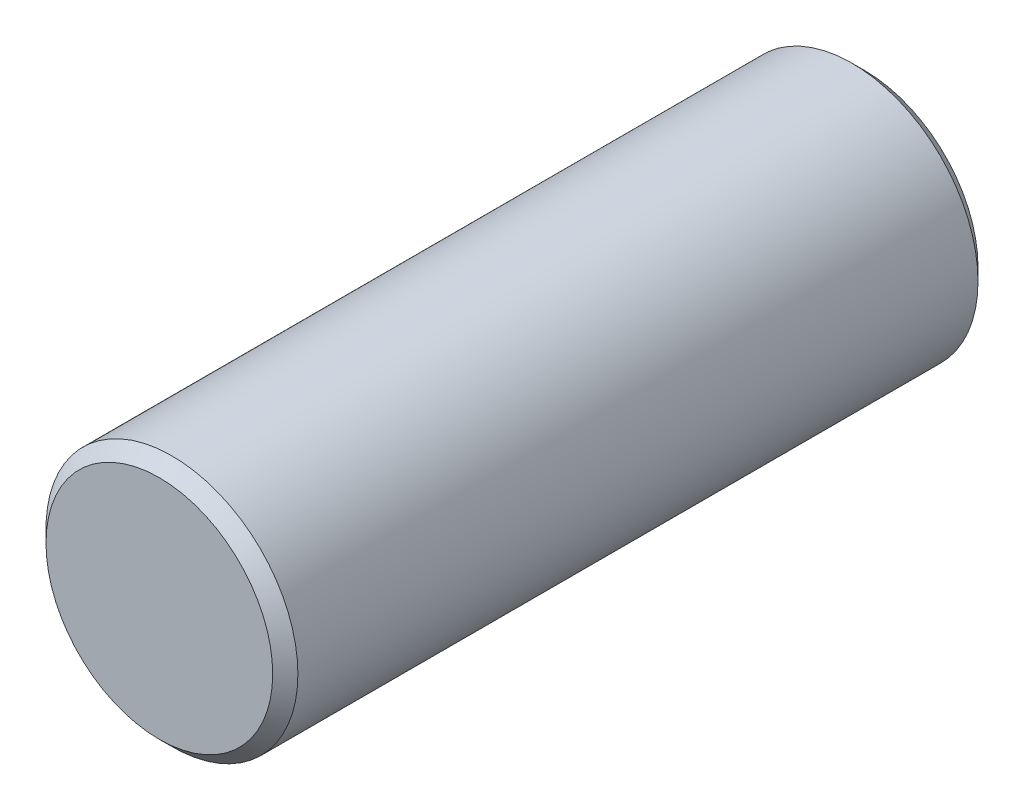
ISO-10303-21;
HEADER;
FILE_DESCRIPTION(('STEP AP214'),'2;1');
FILE_NAME('part.step','',(''),(''),'','','');
FILE_SCHEMA(('AUTOMOTIVE_DESIGN { 1 0 10303 214 1 1 1 1 }'));
ENDSEC;
DATA;
#1=APPLICATION_CONTEXT('core data for automotive mechanical design processes');
#2=APPLICATION_PROTOCOL_DEFINITION('international standard','automotive_design',2000,#1);
#3=PRODUCT_CONTEXT('',#1,'mechanical');
#4=PRODUCT('Part','Part','',(#3));
#5=PRODUCT_RELATED_PRODUCT_CATEGORY('part','',(#4));
#6=PRODUCT_DEFINITION_FORMATION('','',#4);
#7=PRODUCT_DEFINITION_CONTEXT('part definition',#1,'design');
#8=PRODUCT_DEFINITION('design','',#6,#7);
#9=PRODUCT_DEFINITION_SHAPE('','',#8);
#10=(LENGTH_UNIT() NAMED_UNIT(*) SI_UNIT(.MILLI.,.METRE.));
#11=(NAMED_UNIT(*) PLANE_ANGLE_UNIT() SI_UNIT($,.RADIAN.));
#12=(NAMED_UNIT(*) SI_UNIT($,.STERADIAN.) SOLID_ANGLE_UNIT());
#13=UNCERTAINTY_MEASURE_WITH_UNIT(LENGTH_MEASURE(1.E-05),#10,'distance_accuracy_value','');
#14=(GEOMETRIC_REPRESENTATION_CONTEXT(3) GLOBAL_UNCERTAINTY_ASSIGNED_CONTEXT((#13)) GLOBAL_UNIT_ASSIGNED_CONTEXT((#10,
#11,#12)) REPRESENTATION_CONTEXT('',''));
#15=CARTESIAN_POINT('',(0.,0.,0.));
#16=DIRECTION('',(0.,0.,1.));
#17=DIRECTION('',(1.,0.,0.));
#18=AXIS2_PLACEMENT_3D('',#15,#16,#17);
#19=CARTESIAN_POINT('',(0.,0.,28.));
#20=DIRECTION('',(0.,0.,-1.));
#21=DIRECTION('',(-1.,0.,0.));
#22=AXIS2_PLACEMENT_3D('',#19,#20,#21);
#23=CYLINDRICAL_SURFACE('',#22,5.);
#24=CARTESIAN_POINT('',(0.,0.,0.5));
#25=DIRECTION('',(0.,0.,1.));
#26=DIRECTION('',(1.,0.,0.));
#27=AXIS2_PLACEMENT_3D('',#24,#25,#26);
#28=CIRCLE('',#27,5.);
#29=CARTESIAN_POINT('',(5.,0.,0.5));
#30=VERTEX_POINT('',#29);
#31=EDGE_CURVE('E48',#30,#30,#28,.T.);
#32=ORIENTED_EDGE('',*,*,#31,.T.);
#33=EDGE_LOOP('',(#32));
#34=FACE_BOUND('',#33,.T.);
#35=CARTESIAN_POINT('',(0.,0.,27.5));
#36=DIRECTION('',(0.,0.,1.));
#37=DIRECTION('',(1.,0.,0.));
#38=AXIS2_PLACEMENT_3D('',#35,#36,#37);
#39=CIRCLE('',#38,5.);
#40=CARTESIAN_POINT('',(5.,0.,27.5));
#41=VERTEX_POINT('',#40);
#42=EDGE_CURVE('E52',#41,#41,#39,.F.);
#43=ORIENTED_EDGE('',*,*,#42,.T.);
#44=EDGE_LOOP('',(#43));
#45=FACE_BOUND('',#44,.T.);
#46=ADVANCED_FACE('F36',(#34,#45),#23,.T.);
#47=CARTESIAN_POINT('',(0.,0.,28.));
#48=DIRECTION('',(0.,0.,1.));
#49=DIRECTION('',(1.,0.,0.));
#50=AXIS2_PLACEMENT_3D('',#47,#48,#49);
#51=PLANE('',#50);
#52=CARTESIAN_POINT('',(0.,0.,28.));
#53=DIRECTION('',(0.,0.,1.));
#54=DIRECTION('',(1.,0.,0.));
#55=AXIS2_PLACEMENT_3D('',#52,#53,#54);
#56=CIRCLE('',#55,4.5);
#57=CARTESIAN_POINT('',(4.5,0.,28.));
#58=VERTEX_POINT('',#57);
#59=EDGE_CURVE('E10',#58,#58,#56,.T.);
#60=ORIENTED_EDGE('',*,*,#59,.T.);
#61=EDGE_LOOP('',(#60));
#62=FACE_BOUND('',#61,.T.);
#63=ADVANCED_FACE('F68',(#62),#51,.T.);
#64=CARTESIAN_POINT('',(0.,0.,0.));
#65=DIRECTION('',(0.,0.,1.));
#66=DIRECTION('',(1.,0.,0.));
#67=AXIS2_PLACEMENT_3D('',#64,#65,#66);
#68=PLANE('',#67);
#69=CARTESIAN_POINT('',(0.,0.,0.));
#70=DIRECTION('',(0.,0.,1.));
#71=DIRECTION('',(1.,0.,0.));
#72=AXIS2_PLACEMENT_3D('',#69,#70,#71);
#73=CIRCLE('',#72,4.5);
#74=CARTESIAN_POINT('',(4.5,0.,0.));
#75=VERTEX_POINT('',#74);
#76=EDGE_CURVE('E44',#75,#75,#73,.F.);
#77=ORIENTED_EDGE('',*,*,#76,.T.);
#78=EDGE_LOOP('',(#77));
#79=FACE_BOUND('',#78,.T.);
#80=ADVANCED_FACE('F65',(#79),#68,.F.);
#81=CARTESIAN_POINT('',(0.,0.,0.5));
#82=DIRECTION('',(0.,0.,1.));
#83=DIRECTION('',(1.,0.,0.));
#84=AXIS2_PLACEMENT_3D('',#81,#82,#83);
#85=CONICAL_SURFACE('',#84,5.,0.785398163397452);
#86=ORIENTED_EDGE('',*,*,#76,.F.);
#87=EDGE_LOOP('',(#86));
#88=FACE_BOUND('',#87,.T.);
#89=ORIENTED_EDGE('',*,*,#31,.F.);
#90=EDGE_LOOP('',(#89));
#91=FACE_BOUND('',#90,.T.);
#92=ADVANCED_FACE('F61',(#88,#91),#85,.T.);
#93=CARTESIAN_POINT('',(0.,0.,28.));
#94=DIRECTION('',(0.,0.,-1.));
#95=DIRECTION('',(-1.,0.,0.));
#96=AXIS2_PLACEMENT_3D('',#93,#94,#95);
#97=CONICAL_SURFACE('',#96,4.5,0.785398163397445);
#98=ORIENTED_EDGE('',*,*,#42,.F.);
#99=EDGE_LOOP('',(#98));
#100=FACE_BOUND('',#99,.T.);
#101=ORIENTED_EDGE('',*,*,#59,.F.);
#102=EDGE_LOOP('',(#101));
#103=FACE_BOUND('',#102,.T.);
#104=ADVANCED_FACE('F39',(#100,#103),#97,.T.);
#105=CLOSED_SHELL('',(#46,#63,#80,#92,#104));
#106=MANIFOLD_SOLID_BREP('B2',#105);
#107=ADVANCED_BREP_SHAPE_REPRESENTATION('',(#18,#106),#14);
#108=SHAPE_DEFINITION_REPRESENTATION(#9,#107);
ENDSEC;
END-ISO-10303-21;
